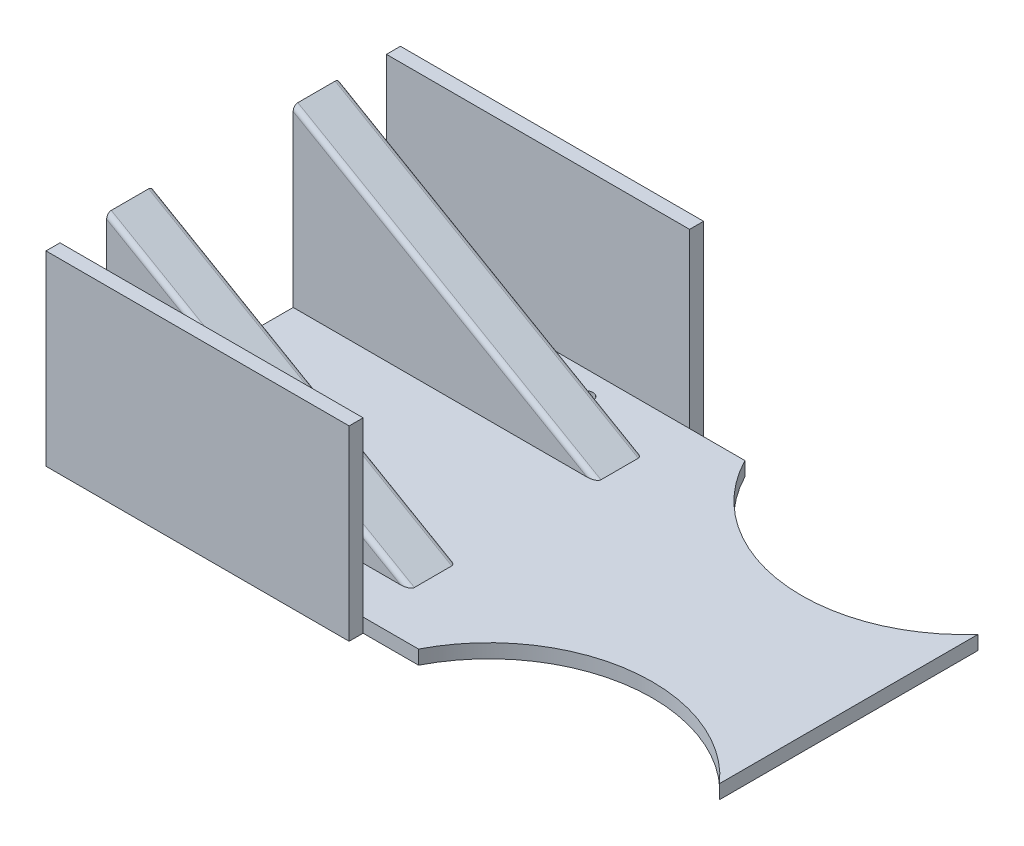
ISO-10303-21;
HEADER;
FILE_DESCRIPTION(('STEP AP214'),'2;1');
FILE_NAME('part.step','',(''),(''),'','','');
FILE_SCHEMA(('AUTOMOTIVE_DESIGN { 1 0 10303 214 1 1 1 1 }'));
ENDSEC;
DATA;
#1=APPLICATION_CONTEXT('core data for automotive mechanical design processes');
#2=APPLICATION_PROTOCOL_DEFINITION('international standard','automotive_design',2000,#1);
#3=PRODUCT_CONTEXT('',#1,'mechanical');
#4=PRODUCT('Part','Part','',(#3));
#5=PRODUCT_RELATED_PRODUCT_CATEGORY('part','',(#4));
#6=PRODUCT_DEFINITION_FORMATION('','',#4);
#7=PRODUCT_DEFINITION_CONTEXT('part definition',#1,'design');
#8=PRODUCT_DEFINITION('design','',#6,#7);
#9=PRODUCT_DEFINITION_SHAPE('','',#8);
#10=(LENGTH_UNIT() NAMED_UNIT(*) SI_UNIT(.MILLI.,.METRE.));
#11=(NAMED_UNIT(*) PLANE_ANGLE_UNIT() SI_UNIT($,.RADIAN.));
#12=(NAMED_UNIT(*) SI_UNIT($,.STERADIAN.) SOLID_ANGLE_UNIT());
#13=UNCERTAINTY_MEASURE_WITH_UNIT(LENGTH_MEASURE(1.E-05),#10,'distance_accuracy_value','');
#14=(GEOMETRIC_REPRESENTATION_CONTEXT(3) GLOBAL_UNCERTAINTY_ASSIGNED_CONTEXT((#13)) GLOBAL_UNIT_ASSIGNED_CONTEXT((#10,
#11,#12)) REPRESENTATION_CONTEXT('',''));
#15=CARTESIAN_POINT('',(0.,0.,0.));
#16=DIRECTION('',(0.,0.,1.));
#17=DIRECTION('',(1.,0.,0.));
#18=AXIS2_PLACEMENT_3D('',#15,#16,#17);
#19=CARTESIAN_POINT('',(0.,3.,0.));
#20=DIRECTION('',(0.,1.,0.));
#21=DIRECTION('',(0.,0.,1.));
#22=AXIS2_PLACEMENT_3D('',#19,#20,#21);
#23=PLANE('',#22);
#24=CARTESIAN_POINT('',(-74.7667848025547,3.,-29.8600592254599));
#25=DIRECTION('',(0.,1.,0.));
#26=DIRECTION('',(0.,0.,1.));
#27=AXIS2_PLACEMENT_3D('',#24,#25,#26);
#28=CIRCLE('',#27,1.5);
#29=CARTESIAN_POINT('',(-74.7667848025547,3.,-28.3600592254599));
#30=VERTEX_POINT('',#29);
#31=EDGE_CURVE('E591',#30,#30,#28,.T.);
#32=ORIENTED_EDGE('',*,*,#31,.F.);
#33=EDGE_LOOP('',(#32));
#34=FACE_BOUND('',#33,.T.);
#35=CARTESIAN_POINT('',(-54.7667848025547,3.,-29.8600592254599));
#36=DIRECTION('',(0.,1.,0.));
#37=DIRECTION('',(0.,0.,1.));
#38=AXIS2_PLACEMENT_3D('',#35,#36,#37);
#39=CIRCLE('',#38,1.5);
#40=CARTESIAN_POINT('',(-54.7667848025547,3.,-28.3600592254599));
#41=VERTEX_POINT('',#40);
#42=EDGE_CURVE('E592',#41,#41,#39,.T.);
#43=ORIENTED_EDGE('',*,*,#42,.F.);
#44=EDGE_LOOP('',(#43));
#45=FACE_BOUND('',#44,.T.);
#46=CARTESIAN_POINT('',(-34.7667848025547,3.,-29.8600592254599));
#47=DIRECTION('',(0.,1.,0.));
#48=DIRECTION('',(0.,0.,1.));
#49=AXIS2_PLACEMENT_3D('',#46,#47,#48);
#50=CIRCLE('',#49,1.5);
#51=CARTESIAN_POINT('',(-34.7667848025547,3.,-28.3600592254599));
#52=VERTEX_POINT('',#51);
#53=EDGE_CURVE('E600',#52,#52,#50,.T.);
#54=ORIENTED_EDGE('',*,*,#53,.F.);
#55=EDGE_LOOP('',(#54));
#56=FACE_BOUND('',#55,.T.);
#57=CARTESIAN_POINT('',(-34.7667848025547,3.,29.8600592254599));
#58=DIRECTION('',(0.,1.,0.));
#59=DIRECTION('',(0.,0.,-1.));
#60=AXIS2_PLACEMENT_3D('',#57,#58,#59);
#61=CIRCLE('',#60,1.5);
#62=CARTESIAN_POINT('',(-34.7667848025547,3.,28.3600592254599));
#63=VERTEX_POINT('',#62);
#64=EDGE_CURVE('E578',#63,#63,#61,.T.);
#65=ORIENTED_EDGE('',*,*,#64,.F.);
#66=EDGE_LOOP('',(#65));
#67=FACE_BOUND('',#66,.T.);
#68=CARTESIAN_POINT('',(-54.7667848025547,3.,29.8600592254599));
#69=DIRECTION('',(0.,1.,0.));
#70=DIRECTION('',(0.,0.,-1.));
#71=AXIS2_PLACEMENT_3D('',#68,#69,#70);
#72=CIRCLE('',#71,1.5);
#73=CARTESIAN_POINT('',(-54.7667848025547,3.,28.3600592254599));
#74=VERTEX_POINT('',#73);
#75=EDGE_CURVE('E571',#74,#74,#72,.T.);
#76=ORIENTED_EDGE('',*,*,#75,.F.);
#77=EDGE_LOOP('',(#76));
#78=FACE_BOUND('',#77,.T.);
#79=CARTESIAN_POINT('',(-74.7667848025547,3.,29.8600592254599));
#80=DIRECTION('',(0.,1.,0.));
#81=DIRECTION('',(0.,0.,-1.));
#82=AXIS2_PLACEMENT_3D('',#79,#80,#81);
#83=CIRCLE('',#82,1.5);
#84=CARTESIAN_POINT('',(-74.7667848025547,3.,28.3600592254599));
#85=VERTEX_POINT('',#84);
#86=EDGE_CURVE('E581',#85,#85,#83,.T.);
#87=ORIENTED_EDGE('',*,*,#86,.F.);
#88=EDGE_LOOP('',(#87));
#89=FACE_BOUND('',#88,.T.);
#90=CARTESIAN_POINT('',(25.2953736654804,3.,51.));
#91=DIRECTION('',(0.,1.,0.));
#92=DIRECTION('',(0.,0.,-1.));
#93=AXIS2_PLACEMENT_3D('',#90,#91,#92);
#94=CIRCLE('',#93,35.);
#95=CARTESIAN_POINT('',(51.4241384980272,3.,27.7129295890301));
#96=VERTEX_POINT('',#95);
#97=CARTESIAN_POINT('',(-5.83339116706635,3.,35.));
#98=VERTEX_POINT('',#97);
#99=EDGE_CURVE('E379',#96,#98,#94,.T.);
#100=ORIENTED_EDGE('',*,*,#99,.F.);
#101=DIRECTION('',(0.,0.,-1.));
#102=VECTOR('',#101,1.);
#103=CARTESIAN_POINT('',(51.4241384980272,3.,0.));
#104=LINE('',#103,#102);
#105=CARTESIAN_POINT('',(51.4241384980272,3.,-27.7129295890301));
#106=VERTEX_POINT('',#105);
#107=EDGE_CURVE('E197',#96,#106,#104,.T.);
#108=ORIENTED_EDGE('',*,*,#107,.T.);
#109=CARTESIAN_POINT('',(25.2953736654804,3.,-51.));
#110=DIRECTION('',(0.,1.,0.));
#111=DIRECTION('',(0.,0.,1.));
#112=AXIS2_PLACEMENT_3D('',#109,#110,#111);
#113=CIRCLE('',#112,35.);
#114=CARTESIAN_POINT('',(-5.83339116706635,3.,-35.));
#115=VERTEX_POINT('',#114);
#116=EDGE_CURVE('E385',#115,#106,#113,.T.);
#117=ORIENTED_EDGE('',*,*,#116,.F.);
#118=DIRECTION('',(-1.,0.,0.));
#119=VECTOR('',#118,1.);
#120=CARTESIAN_POINT('',(-82.7046263345196,3.,-35.));
#121=LINE('',#120,#119);
#122=CARTESIAN_POINT('',(-17.7046263345196,3.,-35.));
#123=VERTEX_POINT('',#122);
#124=EDGE_CURVE('E318',#115,#123,#121,.T.);
#125=ORIENTED_EDGE('',*,*,#124,.T.);
#126=DIRECTION('',(1.,0.,0.));
#127=VECTOR('',#126,1.);
#128=CARTESIAN_POINT('',(0.,3.,-35.));
#129=LINE('',#128,#127);
#130=CARTESIAN_POINT('',(-82.7046263345196,3.,-35.));
#131=VERTEX_POINT('',#130);
#132=EDGE_CURVE('E360',#131,#123,#129,.T.);
#133=ORIENTED_EDGE('',*,*,#132,.F.);
#134=DIRECTION('',(0.,0.,1.));
#135=VECTOR('',#134,1.);
#136=CARTESIAN_POINT('',(-82.7046263345196,3.,35.));
#137=LINE('',#136,#135);
#138=CARTESIAN_POINT('',(-82.7046263345196,3.,-25.));
#139=VERTEX_POINT('',#138);
#140=EDGE_CURVE('E323',#131,#139,#137,.T.);
#141=ORIENTED_EDGE('',*,*,#140,.T.);
#142=DIRECTION('',(1.,0.,0.));
#143=VECTOR('',#142,1.);
#144=CARTESIAN_POINT('',(-82.7046263345196,3.,-25.));
#145=LINE('',#144,#143);
#146=CARTESIAN_POINT('',(-19.7046263345196,3.,-25.));
#147=VERTEX_POINT('',#146);
#148=EDGE_CURVE('E315',#139,#147,#145,.T.);
#149=ORIENTED_EDGE('',*,*,#148,.T.);
#150=CARTESIAN_POINT('',(-19.7046263345196,3.,-24.));
#151=DIRECTION('',(0.,1.,0.));
#152=DIRECTION('',(-1.,0.,0.));
#153=AXIS2_PLACEMENT_3D('',#150,#151,#152);
#154=ELLIPSE('',#153,2.,1.);
#155=CARTESIAN_POINT('',(-17.7046263345196,3.,-24.));
#156=VERTEX_POINT('',#155);
#157=EDGE_CURVE('E272',#147,#156,#154,.F.);
#158=ORIENTED_EDGE('',*,*,#157,.T.);
#159=DIRECTION('',(0.,0.,1.));
#160=VECTOR('',#159,1.);
#161=CARTESIAN_POINT('',(-17.7046263345196,3.,-25.));
#162=LINE('',#161,#160);
#163=CARTESIAN_POINT('',(-17.7046263345196,3.,-16.));
#164=VERTEX_POINT('',#163);
#165=EDGE_CURVE('E283',#156,#164,#162,.T.);
#166=ORIENTED_EDGE('',*,*,#165,.T.);
#167=CARTESIAN_POINT('',(-19.7046263345196,3.,-16.));
#168=DIRECTION('',(0.,1.,0.));
#169=DIRECTION('',(1.,0.,0.));
#170=AXIS2_PLACEMENT_3D('',#167,#168,#169);
#171=ELLIPSE('',#170,2.,1.);
#172=CARTESIAN_POINT('',(-19.7046263345196,3.,-15.));
#173=VERTEX_POINT('',#172);
#174=EDGE_CURVE('E50',#164,#173,#171,.F.);
#175=ORIENTED_EDGE('',*,*,#174,.T.);
#176=DIRECTION('',(-1.,0.,0.));
#177=VECTOR('',#176,1.);
#178=CARTESIAN_POINT('',(137.29537366548,3.,-15.));
#179=LINE('',#178,#177);
#180=CARTESIAN_POINT('',(-82.7046263345196,3.,-15.));
#181=VERTEX_POINT('',#180);
#182=EDGE_CURVE('E280',#173,#181,#179,.T.);
#183=ORIENTED_EDGE('',*,*,#182,.T.);
#184=DIRECTION('',(0.,0.,1.));
#185=VECTOR('',#184,1.);
#186=CARTESIAN_POINT('',(-82.7046263345196,3.,-15.));
#187=LINE('',#186,#185);
#188=CARTESIAN_POINT('',(-82.7046263345196,3.,15.));
#189=VERTEX_POINT('',#188);
#190=EDGE_CURVE('E399',#181,#189,#187,.T.);
#191=ORIENTED_EDGE('',*,*,#190,.T.);
#192=DIRECTION('',(-1.,0.,0.));
#193=VECTOR('',#192,1.);
#194=CARTESIAN_POINT('',(137.29537366548,3.,15.));
#195=LINE('',#194,#193);
#196=CARTESIAN_POINT('',(-19.7046263345196,3.,15.));
#197=VERTEX_POINT('',#196);
#198=EDGE_CURVE('E293',#197,#189,#195,.T.);
#199=ORIENTED_EDGE('',*,*,#198,.F.);
#200=CARTESIAN_POINT('',(-19.7046263345196,3.,16.));
#201=DIRECTION('',(0.,1.,0.));
#202=DIRECTION('',(-1.,0.,0.));
#203=AXIS2_PLACEMENT_3D('',#200,#201,#202);
#204=ELLIPSE('',#203,2.,1.);
#205=CARTESIAN_POINT('',(-17.7046263345196,3.,16.));
#206=VERTEX_POINT('',#205);
#207=EDGE_CURVE('E11',#197,#206,#204,.F.);
#208=ORIENTED_EDGE('',*,*,#207,.T.);
#209=CARTESIAN_POINT('',(-17.7046263345196,3.,24.));
#210=VERTEX_POINT('',#209);
#211=EDGE_CURVE('E307',#206,#210,#162,.T.);
#212=ORIENTED_EDGE('',*,*,#211,.T.);
#213=CARTESIAN_POINT('',(-19.7046263345196,3.,24.));
#214=DIRECTION('',(0.,1.,0.));
#215=DIRECTION('',(1.,0.,0.));
#216=AXIS2_PLACEMENT_3D('',#213,#214,#215);
#217=ELLIPSE('',#216,2.,1.);
#218=CARTESIAN_POINT('',(-19.7046263345196,3.,25.));
#219=VERTEX_POINT('',#218);
#220=EDGE_CURVE('E269',#210,#219,#217,.F.);
#221=ORIENTED_EDGE('',*,*,#220,.T.);
#222=DIRECTION('',(1.,0.,0.));
#223=VECTOR('',#222,1.);
#224=CARTESIAN_POINT('',(-82.7046263345196,3.,25.));
#225=LINE('',#224,#223);
#226=CARTESIAN_POINT('',(-82.7046263345196,3.,25.));
#227=VERTEX_POINT('',#226);
#228=EDGE_CURVE('E410',#227,#219,#225,.T.);
#229=ORIENTED_EDGE('',*,*,#228,.F.);
#230=CARTESIAN_POINT('',(-82.7046263345196,3.,35.));
#231=VERTEX_POINT('',#230);
#232=EDGE_CURVE('E322',#227,#231,#137,.T.);
#233=ORIENTED_EDGE('',*,*,#232,.T.);
#234=DIRECTION('',(1.,0.,0.));
#235=VECTOR('',#234,1.);
#236=CARTESIAN_POINT('',(-82.7046263345196,3.,35.));
#237=LINE('',#236,#235);
#238=CARTESIAN_POINT('',(-17.7046263345196,3.,35.));
#239=VERTEX_POINT('',#238);
#240=EDGE_CURVE('E218',#231,#239,#237,.T.);
#241=ORIENTED_EDGE('',*,*,#240,.T.);
#242=EDGE_CURVE('E225',#239,#98,#237,.T.);
#243=ORIENTED_EDGE('',*,*,#242,.T.);
#244=EDGE_LOOP('',(#100,#108,#117,#125,#133,#141,#149,#158,#166,#175,#183,#191,#199,#208,#212,
#221,#229,#233,#241,#243));
#245=FACE_BOUND('',#244,.T.);
#246=ADVANCED_FACE('F41',(#34,#45,#56,#67,#78,#89,#245),#23,.T.);
#247=CARTESIAN_POINT('',(0.,0.,0.));
#248=DIRECTION('',(0.,1.,0.));
#249=DIRECTION('',(0.,0.,1.));
#250=AXIS2_PLACEMENT_3D('',#247,#248,#249);
#251=PLANE('',#250);
#252=CARTESIAN_POINT('',(-74.7667848025547,0.,-29.8600592254599));
#253=DIRECTION('',(0.,1.,0.));
#254=DIRECTION('',(0.,0.,1.));
#255=AXIS2_PLACEMENT_3D('',#252,#253,#254);
#256=CIRCLE('',#255,1.5);
#257=CARTESIAN_POINT('',(-74.7667848025547,0.,-28.3600592254599));
#258=VERTEX_POINT('',#257);
#259=EDGE_CURVE('E611',#258,#258,#256,.T.);
#260=ORIENTED_EDGE('',*,*,#259,.T.);
#261=EDGE_LOOP('',(#260));
#262=FACE_BOUND('',#261,.T.);
#263=CARTESIAN_POINT('',(-54.7667848025547,0.,-29.8600592254599));
#264=DIRECTION('',(0.,1.,0.));
#265=DIRECTION('',(0.,0.,1.));
#266=AXIS2_PLACEMENT_3D('',#263,#264,#265);
#267=CIRCLE('',#266,1.5);
#268=CARTESIAN_POINT('',(-54.7667848025547,0.,-28.3600592254599));
#269=VERTEX_POINT('',#268);
#270=EDGE_CURVE('E587',#269,#269,#267,.T.);
#271=ORIENTED_EDGE('',*,*,#270,.T.);
#272=EDGE_LOOP('',(#271));
#273=FACE_BOUND('',#272,.T.);
#274=CARTESIAN_POINT('',(-34.7667848025547,0.,-29.8600592254599));
#275=DIRECTION('',(0.,1.,0.));
#276=DIRECTION('',(0.,0.,1.));
#277=AXIS2_PLACEMENT_3D('',#274,#275,#276);
#278=CIRCLE('',#277,1.5);
#279=CARTESIAN_POINT('',(-34.7667848025547,0.,-28.3600592254599));
#280=VERTEX_POINT('',#279);
#281=EDGE_CURVE('E596',#280,#280,#278,.T.);
#282=ORIENTED_EDGE('',*,*,#281,.T.);
#283=EDGE_LOOP('',(#282));
#284=FACE_BOUND('',#283,.T.);
#285=CARTESIAN_POINT('',(-34.7667848025547,0.,29.8600592254599));
#286=DIRECTION('',(0.,1.,0.));
#287=DIRECTION('',(0.,0.,-1.));
#288=AXIS2_PLACEMENT_3D('',#285,#286,#287);
#289=CIRCLE('',#288,1.5);
#290=CARTESIAN_POINT('',(-34.7667848025547,0.,28.3600592254599));
#291=VERTEX_POINT('',#290);
#292=EDGE_CURVE('E604',#291,#291,#289,.T.);
#293=ORIENTED_EDGE('',*,*,#292,.T.);
#294=EDGE_LOOP('',(#293));
#295=FACE_BOUND('',#294,.T.);
#296=CARTESIAN_POINT('',(-54.7667848025547,0.,29.8600592254599));
#297=DIRECTION('',(0.,1.,0.));
#298=DIRECTION('',(0.,0.,-1.));
#299=AXIS2_PLACEMENT_3D('',#296,#297,#298);
#300=CIRCLE('',#299,1.5);
#301=CARTESIAN_POINT('',(-54.7667848025547,0.,28.3600592254599));
#302=VERTEX_POINT('',#301);
#303=EDGE_CURVE('E568',#302,#302,#300,.T.);
#304=ORIENTED_EDGE('',*,*,#303,.T.);
#305=EDGE_LOOP('',(#304));
#306=FACE_BOUND('',#305,.T.);
#307=CARTESIAN_POINT('',(-74.7667848025547,0.,29.8600592254599));
#308=DIRECTION('',(0.,1.,0.));
#309=DIRECTION('',(0.,0.,-1.));
#310=AXIS2_PLACEMENT_3D('',#307,#308,#309);
#311=CIRCLE('',#310,1.5);
#312=CARTESIAN_POINT('',(-74.7667848025547,0.,28.3600592254599));
#313=VERTEX_POINT('',#312);
#314=EDGE_CURVE('E574',#313,#313,#311,.T.);
#315=ORIENTED_EDGE('',*,*,#314,.T.);
#316=EDGE_LOOP('',(#315));
#317=FACE_BOUND('',#316,.T.);
#318=DIRECTION('',(0.,0.,-1.));
#319=VECTOR('',#318,1.);
#320=CARTESIAN_POINT('',(51.4241384980272,0.,0.));
#321=LINE('',#320,#319);
#322=CARTESIAN_POINT('',(51.4241384980272,0.,27.7129295890301));
#323=VERTEX_POINT('',#322);
#324=CARTESIAN_POINT('',(51.4241384980272,0.,-27.7129295890301));
#325=VERTEX_POINT('',#324);
#326=EDGE_CURVE('E57',#323,#325,#321,.T.);
#327=ORIENTED_EDGE('',*,*,#326,.F.);
#328=CARTESIAN_POINT('',(25.2953736654804,0.,51.));
#329=DIRECTION('',(0.,1.,0.));
#330=DIRECTION('',(0.,0.,1.));
#331=AXIS2_PLACEMENT_3D('',#328,#329,#330);
#332=CIRCLE('',#331,35.);
#333=CARTESIAN_POINT('',(-5.83339116706635,0.,35.));
#334=VERTEX_POINT('',#333);
#335=EDGE_CURVE('E207',#323,#334,#332,.T.);
#336=ORIENTED_EDGE('',*,*,#335,.T.);
#337=DIRECTION('',(1.,0.,0.));
#338=VECTOR('',#337,1.);
#339=CARTESIAN_POINT('',(-82.7046263345196,0.,35.));
#340=LINE('',#339,#338);
#341=CARTESIAN_POINT('',(-17.7046263345196,0.,35.));
#342=VERTEX_POINT('',#341);
#343=EDGE_CURVE('E228',#342,#334,#340,.T.);
#344=ORIENTED_EDGE('',*,*,#343,.F.);
#345=DIRECTION('',(0.,0.,1.));
#346=VECTOR('',#345,1.);
#347=CARTESIAN_POINT('',(-17.7046263345196,0.,38.));
#348=LINE('',#347,#346);
#349=CARTESIAN_POINT('',(-17.7046263345196,0.,38.));
#350=VERTEX_POINT('',#349);
#351=EDGE_CURVE('E342',#342,#350,#348,.T.);
#352=ORIENTED_EDGE('',*,*,#351,.T.);
#353=DIRECTION('',(-1.,0.,0.));
#354=VECTOR('',#353,1.);
#355=CARTESIAN_POINT('',(-17.7046263345196,0.,38.));
#356=LINE('',#355,#354);
#357=CARTESIAN_POINT('',(-82.7046263345196,0.,38.));
#358=VERTEX_POINT('',#357);
#359=EDGE_CURVE('E343',#350,#358,#356,.T.);
#360=ORIENTED_EDGE('',*,*,#359,.T.);
#361=DIRECTION('',(0.,0.,1.));
#362=VECTOR('',#361,1.);
#363=CARTESIAN_POINT('',(-82.7046263345196,0.,35.));
#364=LINE('',#363,#362);
#365=CARTESIAN_POINT('',(-82.7046263345196,0.,-38.));
#366=VERTEX_POINT('',#365);
#367=EDGE_CURVE('E329',#366,#358,#364,.T.);
#368=ORIENTED_EDGE('',*,*,#367,.F.);
#369=DIRECTION('',(-1.,0.,0.));
#370=VECTOR('',#369,1.);
#371=CARTESIAN_POINT('',(-17.7046263345196,0.,-38.));
#372=LINE('',#371,#370);
#373=CARTESIAN_POINT('',(-17.7046263345196,0.,-38.));
#374=VERTEX_POINT('',#373);
#375=EDGE_CURVE('E636',#374,#366,#372,.T.);
#376=ORIENTED_EDGE('',*,*,#375,.F.);
#377=DIRECTION('',(0.,0.,1.));
#378=VECTOR('',#377,1.);
#379=CARTESIAN_POINT('',(-17.7046263345196,0.,-38.));
#380=LINE('',#379,#378);
#381=CARTESIAN_POINT('',(-17.7046263345196,0.,-35.));
#382=VERTEX_POINT('',#381);
#383=EDGE_CURVE('E623',#374,#382,#380,.T.);
#384=ORIENTED_EDGE('',*,*,#383,.T.);
#385=DIRECTION('',(-1.,0.,0.));
#386=VECTOR('',#385,1.);
#387=CARTESIAN_POINT('',(-82.7046263345196,0.,-35.));
#388=LINE('',#387,#386);
#389=CARTESIAN_POINT('',(-5.83339116706635,0.,-35.));
#390=VERTEX_POINT('',#389);
#391=EDGE_CURVE('E327',#390,#382,#388,.T.);
#392=ORIENTED_EDGE('',*,*,#391,.F.);
#393=CARTESIAN_POINT('',(25.2953736654804,0.,-51.));
#394=DIRECTION('',(0.,1.,0.));
#395=DIRECTION('',(0.,0.,1.));
#396=AXIS2_PLACEMENT_3D('',#393,#394,#395);
#397=CIRCLE('',#396,35.);
#398=EDGE_CURVE('E210',#390,#325,#397,.T.);
#399=ORIENTED_EDGE('',*,*,#398,.T.);
#400=EDGE_LOOP('',(#327,#336,#344,#352,#360,#368,#376,#384,#392,#399));
#401=FACE_BOUND('',#400,.T.);
#402=ADVANCED_FACE('F206',(#262,#273,#284,#295,#306,#317,#401),#251,.F.);
#403=CARTESIAN_POINT('',(25.2953736654804,0.,51.));
#404=DIRECTION('',(0.,1.,0.));
#405=DIRECTION('',(0.,0.,1.));
#406=AXIS2_PLACEMENT_3D('',#403,#404,#405);
#407=CYLINDRICAL_SURFACE('',#406,35.);
#408=DIRECTION('',(0.,1.,0.));
#409=VECTOR('',#408,1.);
#410=CARTESIAN_POINT('',(51.4241384980272,0.,27.7129295890301));
#411=LINE('',#410,#409);
#412=EDGE_CURVE('E194',#323,#96,#411,.T.);
#413=ORIENTED_EDGE('',*,*,#412,.T.);
#414=ORIENTED_EDGE('',*,*,#99,.T.);
#415=DIRECTION('',(0.,1.,0.));
#416=VECTOR('',#415,1.);
#417=CARTESIAN_POINT('',(-5.83339116706635,0.,35.));
#418=LINE('',#417,#416);
#419=EDGE_CURVE('E216',#334,#98,#418,.T.);
#420=ORIENTED_EDGE('',*,*,#419,.F.);
#421=ORIENTED_EDGE('',*,*,#335,.F.);
#422=EDGE_LOOP('',(#413,#414,#420,#421));
#423=FACE_BOUND('',#422,.T.);
#424=ADVANCED_FACE('F214',(#423),#407,.F.);
#425=CARTESIAN_POINT('',(25.2953736654804,0.,-51.));
#426=DIRECTION('',(0.,1.,0.));
#427=DIRECTION('',(0.,0.,1.));
#428=AXIS2_PLACEMENT_3D('',#425,#426,#427);
#429=CYLINDRICAL_SURFACE('',#428,35.);
#430=DIRECTION('',(0.,1.,0.));
#431=VECTOR('',#430,1.);
#432=CARTESIAN_POINT('',(51.4241384980272,0.,-27.7129295890301));
#433=LINE('',#432,#431);
#434=EDGE_CURVE('E202',#325,#106,#433,.T.);
#435=ORIENTED_EDGE('',*,*,#434,.F.);
#436=ORIENTED_EDGE('',*,*,#398,.F.);
#437=DIRECTION('',(0.,1.,0.));
#438=VECTOR('',#437,1.);
#439=CARTESIAN_POINT('',(-5.83339116706635,0.,-35.));
#440=LINE('',#439,#438);
#441=EDGE_CURVE('E393',#115,#390,#440,.F.);
#442=ORIENTED_EDGE('',*,*,#441,.F.);
#443=ORIENTED_EDGE('',*,*,#116,.T.);
#444=EDGE_LOOP('',(#435,#436,#442,#443));
#445=FACE_BOUND('',#444,.T.);
#446=ADVANCED_FACE('F457',(#445),#429,.F.);
#447=CARTESIAN_POINT('',(-82.7046263345196,3.,-35.));
#448=DIRECTION('',(0.,0.,1.));
#449=DIRECTION('',(1.,0.,0.));
#450=AXIS2_PLACEMENT_3D('',#447,#448,#449);
#451=PLANE('',#450);
#452=DIRECTION('',(0.,1.,0.));
#453=VECTOR('',#452,1.);
#454=CARTESIAN_POINT('',(-17.7046263345196,0.,-35.));
#455=LINE('',#454,#453);
#456=EDGE_CURVE('E629',#382,#123,#455,.T.);
#457=ORIENTED_EDGE('',*,*,#456,.T.);
#458=ORIENTED_EDGE('',*,*,#124,.F.);
#459=ORIENTED_EDGE('',*,*,#441,.T.);
#460=ORIENTED_EDGE('',*,*,#391,.T.);
#461=EDGE_LOOP('',(#457,#458,#459,#460));
#462=FACE_BOUND('',#461,.T.);
#463=ADVANCED_FACE('F452',(#462),#451,.F.);
#464=CARTESIAN_POINT('',(-82.7046263345196,3.,35.));
#465=DIRECTION('',(0.,0.,-1.));
#466=DIRECTION('',(-1.,0.,0.));
#467=AXIS2_PLACEMENT_3D('',#464,#465,#466);
#468=PLANE('',#467);
#469=ORIENTED_EDGE('',*,*,#242,.F.);
#470=DIRECTION('',(0.,-1.,0.));
#471=VECTOR('',#470,1.);
#472=CARTESIAN_POINT('',(-17.7046263345196,0.,35.));
#473=LINE('',#472,#471);
#474=EDGE_CURVE('E339',#239,#342,#473,.T.);
#475=ORIENTED_EDGE('',*,*,#474,.T.);
#476=ORIENTED_EDGE('',*,*,#343,.T.);
#477=ORIENTED_EDGE('',*,*,#419,.T.);
#478=EDGE_LOOP('',(#469,#475,#476,#477));
#479=FACE_BOUND('',#478,.T.);
#480=ADVANCED_FACE('F337',(#479),#468,.F.);
#481=CARTESIAN_POINT('',(-82.7046263345196,40.5277674973258,-25.));
#482=DIRECTION('',(0.500000000000001,0.866025403784438,0.));
#483=DIRECTION('',(-0.866025403784438,0.500000000000001,0.));
#484=AXIS2_PLACEMENT_3D('',#481,#482,#483);
#485=PLANE('',#484);
#486=DIRECTION('',(0.,0.,1.));
#487=VECTOR('',#486,1.);
#488=CARTESIAN_POINT('',(-82.7046263345196,40.5277674973258,-25.));
#489=LINE('',#488,#487);
#490=CARTESIAN_POINT('',(-82.7046263345196,40.5277674973258,16.));
#491=VERTEX_POINT('',#490);
#492=CARTESIAN_POINT('',(-82.7046263345196,40.5277674973258,24.));
#493=VERTEX_POINT('',#492);
#494=EDGE_CURVE('E308',#491,#493,#489,.T.);
#495=ORIENTED_EDGE('',*,*,#494,.T.);
#496=DIRECTION('',(-0.866025403784438,0.500000000000001,0.));
#497=VECTOR('',#496,1.);
#498=CARTESIAN_POINT('',(-17.7046263345196,3.,24.));
#499=LINE('',#498,#497);
#500=EDGE_CURVE('E249',#493,#210,#499,.F.);
#501=ORIENTED_EDGE('',*,*,#500,.T.);
#502=ORIENTED_EDGE('',*,*,#211,.F.);
#503=DIRECTION('',(0.866025403784438,-0.500000000000001,0.));
#504=VECTOR('',#503,1.);
#505=CARTESIAN_POINT('',(-82.7046263345196,40.5277674973258,16.));
#506=LINE('',#505,#504);
#507=EDGE_CURVE('E246',#206,#491,#506,.F.);
#508=ORIENTED_EDGE('',*,*,#507,.T.);
#509=EDGE_LOOP('',(#495,#501,#502,#508));
#510=FACE_BOUND('',#509,.T.);
#511=ADVANCED_FACE('F438',(#510),#485,.T.);
#512=CARTESIAN_POINT('',(-82.7046263345196,3.,35.));
#513=DIRECTION('',(1.,0.,0.));
#514=DIRECTION('',(0.,0.,-1.));
#515=AXIS2_PLACEMENT_3D('',#512,#513,#514);
#516=PLANE('',#515);
#517=DIRECTION('',(0.,-1.,0.));
#518=VECTOR('',#517,1.);
#519=CARTESIAN_POINT('',(-82.7046263345196,40.5277674973258,25.));
#520=LINE('',#519,#518);
#521=CARTESIAN_POINT('',(-82.7046263345196,39.3730669589465,25.));
#522=VERTEX_POINT('',#521);
#523=EDGE_CURVE('E406',#522,#227,#520,.T.);
#524=ORIENTED_EDGE('',*,*,#523,.F.);
#525=CARTESIAN_POINT('',(-82.7046263345196,39.3730669589465,24.));
#526=DIRECTION('',(1.,0.,0.));
#527=DIRECTION('',(0.,-1.,0.));
#528=AXIS2_PLACEMENT_3D('',#525,#526,#527);
#529=ELLIPSE('',#528,1.15470053837925,1.);
#530=EDGE_CURVE('E243',#522,#493,#529,.F.);
#531=ORIENTED_EDGE('',*,*,#530,.T.);
#532=ORIENTED_EDGE('',*,*,#494,.F.);
#533=CARTESIAN_POINT('',(-82.7046263345196,39.3730669589465,16.));
#534=DIRECTION('',(1.,0.,0.));
#535=DIRECTION('',(0.,1.,0.));
#536=AXIS2_PLACEMENT_3D('',#533,#534,#535);
#537=ELLIPSE('',#536,1.15470053837925,1.);
#538=CARTESIAN_POINT('',(-82.7046263345196,39.3730669589465,15.));
#539=VERTEX_POINT('',#538);
#540=EDGE_CURVE('E234',#491,#539,#537,.F.);
#541=ORIENTED_EDGE('',*,*,#540,.T.);
#542=DIRECTION('',(0.,1.,0.));
#543=VECTOR('',#542,1.);
#544=CARTESIAN_POINT('',(-82.7046263345196,3.,15.));
#545=LINE('',#544,#543);
#546=EDGE_CURVE('E294',#189,#539,#545,.T.);
#547=ORIENTED_EDGE('',*,*,#546,.F.);
#548=ORIENTED_EDGE('',*,*,#190,.F.);
#549=DIRECTION('',(0.,-1.,0.));
#550=VECTOR('',#549,1.);
#551=CARTESIAN_POINT('',(-82.7046263345196,40.5277674973258,-15.));
#552=LINE('',#551,#550);
#553=CARTESIAN_POINT('',(-82.7046263345196,39.3730669589465,-15.));
#554=VERTEX_POINT('',#553);
#555=EDGE_CURVE('E290',#554,#181,#552,.T.);
#556=ORIENTED_EDGE('',*,*,#555,.F.);
#557=CARTESIAN_POINT('',(-82.7046263345196,39.3730669589465,-16.));
#558=DIRECTION('',(1.,0.,0.));
#559=DIRECTION('',(0.,-1.,0.));
#560=AXIS2_PLACEMENT_3D('',#557,#558,#559);
#561=ELLIPSE('',#560,1.15470053837925,1.);
#562=CARTESIAN_POINT('',(-82.7046263345196,40.5277674973258,-16.));
#563=VERTEX_POINT('',#562);
#564=EDGE_CURVE('E237',#554,#563,#561,.F.);
#565=ORIENTED_EDGE('',*,*,#564,.T.);
#566=CARTESIAN_POINT('',(-82.7046263345196,40.5277674973258,-24.));
#567=VERTEX_POINT('',#566);
#568=EDGE_CURVE('E302',#567,#563,#489,.T.);
#569=ORIENTED_EDGE('',*,*,#568,.F.);
#570=CARTESIAN_POINT('',(-82.7046263345196,39.3730669589465,-24.));
#571=DIRECTION('',(1.,0.,0.));
#572=DIRECTION('',(0.,1.,0.));
#573=AXIS2_PLACEMENT_3D('',#570,#571,#572);
#574=ELLIPSE('',#573,1.15470053837925,1.);
#575=CARTESIAN_POINT('',(-82.7046263345196,39.3730669589465,-25.));
#576=VERTEX_POINT('',#575);
#577=EDGE_CURVE('E240',#567,#576,#574,.F.);
#578=ORIENTED_EDGE('',*,*,#577,.T.);
#579=DIRECTION('',(0.,-1.,0.));
#580=VECTOR('',#579,1.);
#581=CARTESIAN_POINT('',(-82.7046263345196,40.5277674973258,-25.));
#582=LINE('',#581,#580);
#583=EDGE_CURVE('E414',#576,#139,#582,.T.);
#584=ORIENTED_EDGE('',*,*,#583,.T.);
#585=ORIENTED_EDGE('',*,*,#140,.F.);
#586=DIRECTION('',(0.,1.,0.));
#587=VECTOR('',#586,1.);
#588=CARTESIAN_POINT('',(-82.7046263345196,0.,-35.));
#589=LINE('',#588,#587);
#590=CARTESIAN_POINT('',(-82.7046263345196,40.,-35.));
#591=VERTEX_POINT('',#590);
#592=EDGE_CURVE('E639',#131,#591,#589,.T.);
#593=ORIENTED_EDGE('',*,*,#592,.T.);
#594=DIRECTION('',(0.,0.,-1.));
#595=VECTOR('',#594,1.);
#596=CARTESIAN_POINT('',(-82.7046263345196,40.,-35.));
#597=LINE('',#596,#595);
#598=CARTESIAN_POINT('',(-82.7046263345196,40.,-38.));
#599=VERTEX_POINT('',#598);
#600=EDGE_CURVE('E624',#591,#599,#597,.T.);
#601=ORIENTED_EDGE('',*,*,#600,.T.);
#602=DIRECTION('',(0.,-1.,0.));
#603=VECTOR('',#602,1.);
#604=CARTESIAN_POINT('',(-82.7046263345196,40.,-38.));
#605=LINE('',#604,#603);
#606=EDGE_CURVE('E615',#599,#366,#605,.T.);
#607=ORIENTED_EDGE('',*,*,#606,.T.);
#608=ORIENTED_EDGE('',*,*,#367,.T.);
#609=DIRECTION('',(0.,1.,0.));
#610=VECTOR('',#609,1.);
#611=CARTESIAN_POINT('',(-82.7046263345196,40.,38.));
#612=LINE('',#611,#610);
#613=CARTESIAN_POINT('',(-82.7046263345196,40.,38.));
#614=VERTEX_POINT('',#613);
#615=EDGE_CURVE('E370',#358,#614,#612,.T.);
#616=ORIENTED_EDGE('',*,*,#615,.T.);
#617=DIRECTION('',(0.,0.,-1.));
#618=VECTOR('',#617,1.);
#619=CARTESIAN_POINT('',(-82.7046263345196,40.,35.));
#620=LINE('',#619,#618);
#621=CARTESIAN_POINT('',(-82.7046263345196,40.,35.));
#622=VERTEX_POINT('',#621);
#623=EDGE_CURVE('E357',#614,#622,#620,.T.);
#624=ORIENTED_EDGE('',*,*,#623,.T.);
#625=DIRECTION('',(0.,-1.,0.));
#626=VECTOR('',#625,1.);
#627=CARTESIAN_POINT('',(-82.7046263345196,0.,35.));
#628=LINE('',#627,#626);
#629=EDGE_CURVE('E349',#622,#231,#628,.T.);
#630=ORIENTED_EDGE('',*,*,#629,.T.);
#631=ORIENTED_EDGE('',*,*,#232,.F.);
#632=EDGE_LOOP('',(#524,#531,#532,#541,#547,#548,#556,#565,#569,#578,#584,#585,#593,#601,#607,
#608,#616,#624,#630,#631));
#633=FACE_BOUND('',#632,.T.);
#634=ADVANCED_FACE('F301',(#633),#516,.F.);
#635=ORIENTED_EDGE('',*,*,#165,.F.);
#636=DIRECTION('',(-0.866025403784438,0.500000000000001,0.));
#637=VECTOR('',#636,1.);
#638=CARTESIAN_POINT('',(-82.7046263345196,40.5277674973258,-24.));
#639=LINE('',#638,#637);
#640=EDGE_CURVE('E255',#156,#567,#639,.T.);
#641=ORIENTED_EDGE('',*,*,#640,.T.);
#642=ORIENTED_EDGE('',*,*,#568,.T.);
#643=DIRECTION('',(-0.866025403784438,0.500000000000001,0.));
#644=VECTOR('',#643,1.);
#645=CARTESIAN_POINT('',(-17.7046263345196,3.,-16.));
#646=LINE('',#645,#644);
#647=EDGE_CURVE('E252',#563,#164,#646,.F.);
#648=ORIENTED_EDGE('',*,*,#647,.T.);
#649=EDGE_LOOP('',(#635,#641,#642,#648));
#650=FACE_BOUND('',#649,.T.);
#651=ADVANCED_FACE('F304',(#650),#485,.T.);
#652=CARTESIAN_POINT('',(0.,0.,-25.));
#653=DIRECTION('',(0.,0.,-1.));
#654=DIRECTION('',(-1.,0.,0.));
#655=AXIS2_PLACEMENT_3D('',#652,#653,#654);
#656=PLANE('',#655);
#657=ORIENTED_EDGE('',*,*,#583,.F.);
#658=DIRECTION('',(-0.866025403784438,0.500000000000001,0.));
#659=VECTOR('',#658,1.);
#660=CARTESIAN_POINT('',(-3.62711847795325,-6.28235348888691,-25.));
#661=LINE('',#660,#659);
#662=EDGE_CURVE('E259',#576,#147,#661,.F.);
#663=ORIENTED_EDGE('',*,*,#662,.T.);
#664=ORIENTED_EDGE('',*,*,#148,.F.);
#665=EDGE_LOOP('',(#657,#663,#664));
#666=FACE_BOUND('',#665,.T.);
#667=ADVANCED_FACE('F426',(#666),#656,.T.);
#668=CARTESIAN_POINT('',(0.,0.,25.));
#669=DIRECTION('',(0.,0.,-1.));
#670=DIRECTION('',(-1.,0.,0.));
#671=AXIS2_PLACEMENT_3D('',#668,#669,#670);
#672=PLANE('',#671);
#673=ORIENTED_EDGE('',*,*,#228,.T.);
#674=DIRECTION('',(-0.866025403784438,0.500000000000001,0.));
#675=VECTOR('',#674,1.);
#676=CARTESIAN_POINT('',(-83.2046263345196,39.6617420935413,25.));
#677=LINE('',#676,#675);
#678=EDGE_CURVE('E222',#219,#522,#677,.T.);
#679=ORIENTED_EDGE('',*,*,#678,.T.);
#680=ORIENTED_EDGE('',*,*,#523,.T.);
#681=EDGE_LOOP('',(#673,#679,#680));
#682=FACE_BOUND('',#681,.T.);
#683=ADVANCED_FACE('F428',(#682),#672,.F.);
#684=CARTESIAN_POINT('',(137.29537366548,3.,15.));
#685=DIRECTION('',(0.,0.,1.));
#686=DIRECTION('',(0.,-1.,0.));
#687=AXIS2_PLACEMENT_3D('',#684,#685,#686);
#688=PLANE('',#687);
#689=ORIENTED_EDGE('',*,*,#546,.T.);
#690=DIRECTION('',(0.866025403784438,-0.500000000000001,0.));
#691=VECTOR('',#690,1.);
#692=CARTESIAN_POINT('',(-18.2046263345196,2.13397459621556,15.));
#693=LINE('',#692,#691);
#694=EDGE_CURVE('E266',#539,#197,#693,.T.);
#695=ORIENTED_EDGE('',*,*,#694,.T.);
#696=ORIENTED_EDGE('',*,*,#198,.T.);
#697=EDGE_LOOP('',(#689,#695,#696));
#698=FACE_BOUND('',#697,.T.);
#699=ADVANCED_FACE('F434',(#698),#688,.F.);
#700=CARTESIAN_POINT('',(137.29537366548,40.5277674973258,-15.));
#701=DIRECTION('',(0.,0.,-1.));
#702=DIRECTION('',(0.,1.,0.));
#703=AXIS2_PLACEMENT_3D('',#700,#701,#702);
#704=PLANE('',#703);
#705=ORIENTED_EDGE('',*,*,#182,.F.);
#706=DIRECTION('',(-0.866025403784438,0.500000000000001,0.));
#707=VECTOR('',#706,1.);
#708=CARTESIAN_POINT('',(-83.2046263345196,39.6617420935413,-15.));
#709=LINE('',#708,#707);
#710=EDGE_CURVE('E262',#173,#554,#709,.T.);
#711=ORIENTED_EDGE('',*,*,#710,.T.);
#712=ORIENTED_EDGE('',*,*,#555,.T.);
#713=EDGE_LOOP('',(#705,#711,#712));
#714=FACE_BOUND('',#713,.T.);
#715=ADVANCED_FACE('F288',(#714),#704,.F.);
#716=CARTESIAN_POINT('',(-17.7046263345196,0.,35.));
#717=DIRECTION('',(0.,0.,-1.));
#718=DIRECTION('',(-1.,0.,0.));
#719=AXIS2_PLACEMENT_3D('',#716,#717,#718);
#720=PLANE('',#719);
#721=CARTESIAN_POINT('',(-17.7046263345196,40.,35.));
#722=VERTEX_POINT('',#721);
#723=EDGE_CURVE('E366',#722,#239,#473,.T.);
#724=ORIENTED_EDGE('',*,*,#723,.T.);
#725=ORIENTED_EDGE('',*,*,#240,.F.);
#726=ORIENTED_EDGE('',*,*,#629,.F.);
#727=DIRECTION('',(-1.,0.,0.));
#728=VECTOR('',#727,1.);
#729=CARTESIAN_POINT('',(-17.7046263345196,40.,35.));
#730=LINE('',#729,#728);
#731=EDGE_CURVE('E376',#722,#622,#730,.T.);
#732=ORIENTED_EDGE('',*,*,#731,.F.);
#733=EDGE_LOOP('',(#724,#725,#726,#732));
#734=FACE_BOUND('',#733,.T.);
#735=ADVANCED_FACE('F495',(#734),#720,.T.);
#736=CARTESIAN_POINT('',(-17.7046263345196,40.,35.));
#737=DIRECTION('',(0.,1.,0.));
#738=DIRECTION('',(0.,0.,1.));
#739=AXIS2_PLACEMENT_3D('',#736,#737,#738);
#740=PLANE('',#739);
#741=ORIENTED_EDGE('',*,*,#623,.F.);
#742=DIRECTION('',(-1.,0.,0.));
#743=VECTOR('',#742,1.);
#744=CARTESIAN_POINT('',(-17.7046263345196,40.,38.));
#745=LINE('',#744,#743);
#746=CARTESIAN_POINT('',(-17.7046263345196,40.,38.));
#747=VERTEX_POINT('',#746);
#748=EDGE_CURVE('E380',#747,#614,#745,.T.);
#749=ORIENTED_EDGE('',*,*,#748,.F.);
#750=DIRECTION('',(0.,0.,-1.));
#751=VECTOR('',#750,1.);
#752=CARTESIAN_POINT('',(-17.7046263345196,40.,35.));
#753=LINE('',#752,#751);
#754=EDGE_CURVE('E354',#747,#722,#753,.T.);
#755=ORIENTED_EDGE('',*,*,#754,.T.);
#756=ORIENTED_EDGE('',*,*,#731,.T.);
#757=EDGE_LOOP('',(#741,#749,#755,#756));
#758=FACE_BOUND('',#757,.T.);
#759=ADVANCED_FACE('F498',(#758),#740,.T.);
#760=CARTESIAN_POINT('',(-17.7046263345196,40.,38.));
#761=DIRECTION('',(0.,0.,1.));
#762=DIRECTION('',(0.,-1.,0.));
#763=AXIS2_PLACEMENT_3D('',#760,#761,#762);
#764=PLANE('',#763);
#765=ORIENTED_EDGE('',*,*,#615,.F.);
#766=ORIENTED_EDGE('',*,*,#359,.F.);
#767=DIRECTION('',(0.,1.,0.));
#768=VECTOR('',#767,1.);
#769=CARTESIAN_POINT('',(-17.7046263345196,40.,38.));
#770=LINE('',#769,#768);
#771=EDGE_CURVE('E348',#350,#747,#770,.T.);
#772=ORIENTED_EDGE('',*,*,#771,.T.);
#773=ORIENTED_EDGE('',*,*,#748,.T.);
#774=EDGE_LOOP('',(#765,#766,#772,#773));
#775=FACE_BOUND('',#774,.T.);
#776=ADVANCED_FACE('F500',(#775),#764,.T.);
#777=CARTESIAN_POINT('',(-17.7046263345196,0.,0.));
#778=DIRECTION('',(1.,0.,0.));
#779=DIRECTION('',(0.,0.,-1.));
#780=AXIS2_PLACEMENT_3D('',#777,#778,#779);
#781=PLANE('',#780);
#782=ORIENTED_EDGE('',*,*,#351,.F.);
#783=ORIENTED_EDGE('',*,*,#474,.F.);
#784=ORIENTED_EDGE('',*,*,#723,.F.);
#785=ORIENTED_EDGE('',*,*,#754,.F.);
#786=ORIENTED_EDGE('',*,*,#771,.F.);
#787=EDGE_LOOP('',(#782,#783,#784,#785,#786));
#788=FACE_BOUND('',#787,.T.);
#789=ADVANCED_FACE('F492',(#788),#781,.T.);
#790=CARTESIAN_POINT('',(-17.7046263345196,40.,-38.));
#791=DIRECTION('',(0.,0.,-1.));
#792=DIRECTION('',(0.,1.,0.));
#793=AXIS2_PLACEMENT_3D('',#790,#791,#792);
#794=PLANE('',#793);
#795=ORIENTED_EDGE('',*,*,#606,.F.);
#796=DIRECTION('',(-1.,0.,0.));
#797=VECTOR('',#796,1.);
#798=CARTESIAN_POINT('',(-17.7046263345196,40.,-38.));
#799=LINE('',#798,#797);
#800=CARTESIAN_POINT('',(-17.7046263345196,40.,-38.));
#801=VERTEX_POINT('',#800);
#802=EDGE_CURVE('E645',#801,#599,#799,.T.);
#803=ORIENTED_EDGE('',*,*,#802,.F.);
#804=DIRECTION('',(0.,-1.,0.));
#805=VECTOR('',#804,1.);
#806=CARTESIAN_POINT('',(-17.7046263345196,40.,-38.));
#807=LINE('',#806,#805);
#808=EDGE_CURVE('E619',#801,#374,#807,.T.);
#809=ORIENTED_EDGE('',*,*,#808,.T.);
#810=ORIENTED_EDGE('',*,*,#375,.T.);
#811=EDGE_LOOP('',(#795,#803,#809,#810));
#812=FACE_BOUND('',#811,.T.);
#813=ADVANCED_FACE('F507',(#812),#794,.T.);
#814=CARTESIAN_POINT('',(-17.7046263345196,40.,-35.));
#815=DIRECTION('',(0.,1.,0.));
#816=DIRECTION('',(0.,0.,1.));
#817=AXIS2_PLACEMENT_3D('',#814,#815,#816);
#818=PLANE('',#817);
#819=ORIENTED_EDGE('',*,*,#600,.F.);
#820=DIRECTION('',(-1.,0.,0.));
#821=VECTOR('',#820,1.);
#822=CARTESIAN_POINT('',(-17.7046263345196,40.,-35.));
#823=LINE('',#822,#821);
#824=CARTESIAN_POINT('',(-17.7046263345196,40.,-35.));
#825=VERTEX_POINT('',#824);
#826=EDGE_CURVE('E648',#825,#591,#823,.T.);
#827=ORIENTED_EDGE('',*,*,#826,.F.);
#828=DIRECTION('',(0.,0.,-1.));
#829=VECTOR('',#828,1.);
#830=CARTESIAN_POINT('',(-17.7046263345196,40.,-35.));
#831=LINE('',#830,#829);
#832=EDGE_CURVE('E632',#825,#801,#831,.T.);
#833=ORIENTED_EDGE('',*,*,#832,.T.);
#834=ORIENTED_EDGE('',*,*,#802,.T.);
#835=EDGE_LOOP('',(#819,#827,#833,#834));
#836=FACE_BOUND('',#835,.T.);
#837=ADVANCED_FACE('F528',(#836),#818,.T.);
#838=CARTESIAN_POINT('',(-17.7046263345196,0.,-35.));
#839=DIRECTION('',(0.,0.,1.));
#840=DIRECTION('',(1.,0.,0.));
#841=AXIS2_PLACEMENT_3D('',#838,#839,#840);
#842=PLANE('',#841);
#843=ORIENTED_EDGE('',*,*,#592,.F.);
#844=ORIENTED_EDGE('',*,*,#132,.T.);
#845=EDGE_CURVE('E628',#123,#825,#455,.T.);
#846=ORIENTED_EDGE('',*,*,#845,.T.);
#847=ORIENTED_EDGE('',*,*,#826,.T.);
#848=EDGE_LOOP('',(#843,#844,#846,#847));
#849=FACE_BOUND('',#848,.T.);
#850=ADVANCED_FACE('F530',(#849),#842,.T.);
#851=CARTESIAN_POINT('',(-17.7046263345196,0.,0.));
#852=DIRECTION('',(-1.,0.,0.));
#853=DIRECTION('',(0.,0.,1.));
#854=AXIS2_PLACEMENT_3D('',#851,#852,#853);
#855=PLANE('',#854);
#856=ORIENTED_EDGE('',*,*,#808,.F.);
#857=ORIENTED_EDGE('',*,*,#832,.F.);
#858=ORIENTED_EDGE('',*,*,#845,.F.);
#859=ORIENTED_EDGE('',*,*,#456,.F.);
#860=ORIENTED_EDGE('',*,*,#383,.F.);
#861=EDGE_LOOP('',(#856,#857,#858,#859,#860));
#862=FACE_BOUND('',#861,.T.);
#863=ADVANCED_FACE('F533',(#862),#855,.F.);
#864=CARTESIAN_POINT('',(-74.7667848025547,0.,-29.8600592254599));
#865=DIRECTION('',(0.,1.,0.));
#866=DIRECTION('',(0.,0.,1.));
#867=AXIS2_PLACEMENT_3D('',#864,#865,#866);
#868=CYLINDRICAL_SURFACE('',#867,1.5);
#869=ORIENTED_EDGE('',*,*,#259,.F.);
#870=EDGE_LOOP('',(#869));
#871=FACE_BOUND('',#870,.T.);
#872=ORIENTED_EDGE('',*,*,#31,.T.);
#873=EDGE_LOOP('',(#872));
#874=FACE_BOUND('',#873,.T.);
#875=ADVANCED_FACE('F540',(#871,#874),#868,.F.);
#876=CARTESIAN_POINT('',(-54.7667848025547,0.,-29.8600592254599));
#877=DIRECTION('',(0.,1.,0.));
#878=DIRECTION('',(0.,0.,1.));
#879=AXIS2_PLACEMENT_3D('',#876,#877,#878);
#880=CYLINDRICAL_SURFACE('',#879,1.5);
#881=ORIENTED_EDGE('',*,*,#270,.F.);
#882=EDGE_LOOP('',(#881));
#883=FACE_BOUND('',#882,.T.);
#884=ORIENTED_EDGE('',*,*,#42,.T.);
#885=EDGE_LOOP('',(#884));
#886=FACE_BOUND('',#885,.T.);
#887=ADVANCED_FACE('F544',(#883,#886),#880,.F.);
#888=CARTESIAN_POINT('',(-34.7667848025547,0.,-29.8600592254599));
#889=DIRECTION('',(0.,1.,0.));
#890=DIRECTION('',(0.,0.,1.));
#891=AXIS2_PLACEMENT_3D('',#888,#889,#890);
#892=CYLINDRICAL_SURFACE('',#891,1.5);
#893=ORIENTED_EDGE('',*,*,#281,.F.);
#894=EDGE_LOOP('',(#893));
#895=FACE_BOUND('',#894,.T.);
#896=ORIENTED_EDGE('',*,*,#53,.T.);
#897=EDGE_LOOP('',(#896));
#898=FACE_BOUND('',#897,.T.);
#899=ADVANCED_FACE('F550',(#895,#898),#892,.F.);
#900=CARTESIAN_POINT('',(-34.7667848025547,0.,29.8600592254599));
#901=DIRECTION('',(0.,1.,0.));
#902=DIRECTION('',(0.,0.,1.));
#903=AXIS2_PLACEMENT_3D('',#900,#901,#902);
#904=CYLINDRICAL_SURFACE('',#903,1.5);
#905=ORIENTED_EDGE('',*,*,#292,.F.);
#906=EDGE_LOOP('',(#905));
#907=FACE_BOUND('',#906,.T.);
#908=ORIENTED_EDGE('',*,*,#64,.T.);
#909=EDGE_LOOP('',(#908));
#910=FACE_BOUND('',#909,.T.);
#911=ADVANCED_FACE('F546',(#907,#910),#904,.F.);
#912=CARTESIAN_POINT('',(-54.7667848025547,0.,29.8600592254599));
#913=DIRECTION('',(0.,1.,0.));
#914=DIRECTION('',(0.,0.,1.));
#915=AXIS2_PLACEMENT_3D('',#912,#913,#914);
#916=CYLINDRICAL_SURFACE('',#915,1.5);
#917=ORIENTED_EDGE('',*,*,#303,.F.);
#918=EDGE_LOOP('',(#917));
#919=FACE_BOUND('',#918,.T.);
#920=ORIENTED_EDGE('',*,*,#75,.T.);
#921=EDGE_LOOP('',(#920));
#922=FACE_BOUND('',#921,.T.);
#923=ADVANCED_FACE('F549',(#919,#922),#916,.F.);
#924=CARTESIAN_POINT('',(-74.7667848025547,0.,29.8600592254599));
#925=DIRECTION('',(0.,1.,0.));
#926=DIRECTION('',(0.,0.,1.));
#927=AXIS2_PLACEMENT_3D('',#924,#925,#926);
#928=CYLINDRICAL_SURFACE('',#927,1.5);
#929=ORIENTED_EDGE('',*,*,#314,.F.);
#930=EDGE_LOOP('',(#929));
#931=FACE_BOUND('',#930,.T.);
#932=ORIENTED_EDGE('',*,*,#86,.T.);
#933=EDGE_LOOP('',(#932));
#934=FACE_BOUND('',#933,.T.);
#935=ADVANCED_FACE('F462',(#931,#934),#928,.F.);
#936=CARTESIAN_POINT('',(-3.62711847795325,-6.2823534888869,24.));
#937=DIRECTION('',(0.866025403784438,-0.500000000000001,0.));
#938=DIRECTION('',(0.500000000000001,0.866025403784438,0.));
#939=AXIS2_PLACEMENT_3D('',#936,#937,#938);
#940=CYLINDRICAL_SURFACE('',#939,1.);
#941=ORIENTED_EDGE('',*,*,#220,.F.);
#942=ORIENTED_EDGE('',*,*,#500,.F.);
#943=ORIENTED_EDGE('',*,*,#530,.F.);
#944=ORIENTED_EDGE('',*,*,#678,.F.);
#945=EDGE_LOOP('',(#941,#942,#943,#944));
#946=FACE_BOUND('',#945,.T.);
#947=ADVANCED_FACE('F459',(#946),#940,.T.);
#948=CARTESIAN_POINT('',(-83.2046263345196,39.6617420935413,-24.));
#949=DIRECTION('',(-0.866025403784438,0.500000000000001,0.));
#950=DIRECTION('',(-0.500000000000001,-0.866025403784438,0.));
#951=AXIS2_PLACEMENT_3D('',#948,#949,#950);
#952=CYLINDRICAL_SURFACE('',#951,1.);
#953=ORIENTED_EDGE('',*,*,#157,.F.);
#954=ORIENTED_EDGE('',*,*,#662,.F.);
#955=ORIENTED_EDGE('',*,*,#577,.F.);
#956=ORIENTED_EDGE('',*,*,#640,.F.);
#957=EDGE_LOOP('',(#953,#954,#955,#956));
#958=FACE_BOUND('',#957,.T.);
#959=ADVANCED_FACE('F425',(#958),#952,.T.);
#960=CARTESIAN_POINT('',(81.7953736654802,-55.6010523227471,-16.));
#961=DIRECTION('',(0.866025403784438,-0.500000000000001,0.));
#962=DIRECTION('',(0.500000000000001,0.866025403784438,0.));
#963=AXIS2_PLACEMENT_3D('',#960,#961,#962);
#964=CYLINDRICAL_SURFACE('',#963,1.);
#965=ORIENTED_EDGE('',*,*,#174,.F.);
#966=ORIENTED_EDGE('',*,*,#647,.F.);
#967=ORIENTED_EDGE('',*,*,#564,.F.);
#968=ORIENTED_EDGE('',*,*,#710,.F.);
#969=EDGE_LOOP('',(#965,#966,#967,#968));
#970=FACE_BOUND('',#969,.T.);
#971=ADVANCED_FACE('F296',(#970),#964,.T.);
#972=CARTESIAN_POINT('',(98.0453736654803,-64.9829941970785,16.));
#973=DIRECTION('',(-0.866025403784438,0.500000000000001,0.));
#974=DIRECTION('',(-0.500000000000001,-0.866025403784438,0.));
#975=AXIS2_PLACEMENT_3D('',#972,#973,#974);
#976=CYLINDRICAL_SURFACE('',#975,1.);
#977=ORIENTED_EDGE('',*,*,#540,.F.);
#978=ORIENTED_EDGE('',*,*,#507,.F.);
#979=ORIENTED_EDGE('',*,*,#207,.F.);
#980=ORIENTED_EDGE('',*,*,#694,.F.);
#981=EDGE_LOOP('',(#977,#978,#979,#980));
#982=FACE_BOUND('',#981,.T.);
#983=ADVANCED_FACE('F43',(#982),#976,.T.);
#984=CARTESIAN_POINT('',(51.4241384980272,0.,0.));
#985=DIRECTION('',(1.,0.,0.));
#986=DIRECTION('',(0.,0.,-1.));
#987=AXIS2_PLACEMENT_3D('',#984,#985,#986);
#988=PLANE('',#987);
#989=ORIENTED_EDGE('',*,*,#107,.F.);
#990=ORIENTED_EDGE('',*,*,#412,.F.);
#991=ORIENTED_EDGE('',*,*,#326,.T.);
#992=ORIENTED_EDGE('',*,*,#434,.T.);
#993=EDGE_LOOP('',(#989,#990,#991,#992));
#994=FACE_BOUND('',#993,.T.);
#995=ADVANCED_FACE('F195',(#994),#988,.T.);
#996=CLOSED_SHELL('',(#246,#402,#424,#446,#463,#480,#511,#634,#651,#667,#683,#699,#715,#735,
#759,#776,#789,#813,#837,#850,#863,#875,#887,#899,#911,#923,#935,#947,#959,#971,#983,#995));
#997=MANIFOLD_SOLID_BREP('B2',#996);
#998=ADVANCED_BREP_SHAPE_REPRESENTATION('',(#18,#997),#14);
#999=SHAPE_DEFINITION_REPRESENTATION(#9,#998);
ENDSEC;
END-ISO-10303-21;
